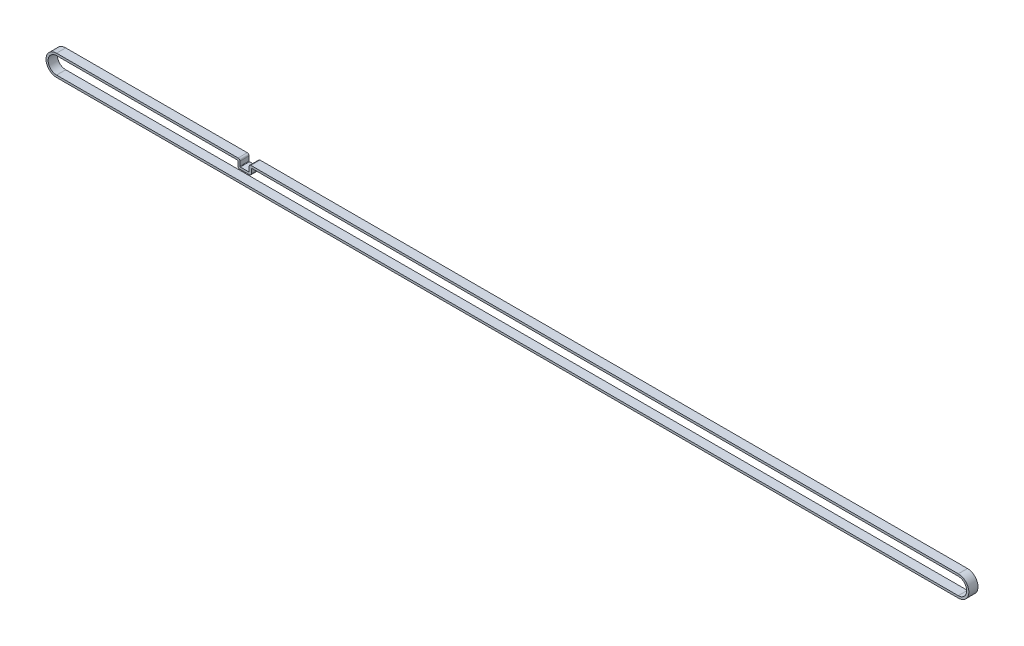
ISO-10303-21;
HEADER;
FILE_DESCRIPTION(('STEP AP214'),'2;1');
FILE_NAME('part.step','',(''),(''),'','','');
FILE_SCHEMA(('AUTOMOTIVE_DESIGN { 1 0 10303 214 1 1 1 1 }'));
ENDSEC;
DATA;
#1=APPLICATION_CONTEXT('core data for automotive mechanical design processes');
#2=APPLICATION_PROTOCOL_DEFINITION('international standard','automotive_design',2000,#1);
#3=PRODUCT_CONTEXT('',#1,'mechanical');
#4=PRODUCT('Part','Part','',(#3));
#5=PRODUCT_RELATED_PRODUCT_CATEGORY('part','',(#4));
#6=PRODUCT_DEFINITION_FORMATION('','',#4);
#7=PRODUCT_DEFINITION_CONTEXT('part definition',#1,'design');
#8=PRODUCT_DEFINITION('design','',#6,#7);
#9=PRODUCT_DEFINITION_SHAPE('','',#8);
#10=(LENGTH_UNIT() NAMED_UNIT(*) SI_UNIT(.MILLI.,.METRE.));
#11=(NAMED_UNIT(*) PLANE_ANGLE_UNIT() SI_UNIT($,.RADIAN.));
#12=(NAMED_UNIT(*) SI_UNIT($,.STERADIAN.) SOLID_ANGLE_UNIT());
#13=UNCERTAINTY_MEASURE_WITH_UNIT(LENGTH_MEASURE(1.E-05),#10,'distance_accuracy_value','');
#14=(GEOMETRIC_REPRESENTATION_CONTEXT(3) GLOBAL_UNCERTAINTY_ASSIGNED_CONTEXT((#13)) GLOBAL_UNIT_ASSIGNED_CONTEXT((#10,
#11,#12)) REPRESENTATION_CONTEXT('',''));
#15=CARTESIAN_POINT('',(0.,0.,0.));
#16=DIRECTION('',(0.,0.,1.));
#17=DIRECTION('',(1.,0.,0.));
#18=AXIS2_PLACEMENT_3D('',#15,#16,#17);
#19=CARTESIAN_POINT('',(0.,0.,6.));
#20=DIRECTION('',(0.,0.,1.));
#21=DIRECTION('',(1.,0.,0.));
#22=AXIS2_PLACEMENT_3D('',#19,#20,#21);
#23=PLANE('',#22);
#24=DIRECTION('',(-1.,0.,0.));
#25=VECTOR('',#24,1.);
#26=CARTESIAN_POINT('',(126.,6.9,6.));
#27=LINE('',#26,#25);
#28=CARTESIAN_POINT('',(590.,6.9,6.));
#29=VERTEX_POINT('',#28);
#30=CARTESIAN_POINT('',(127.2,6.9,6.));
#31=VERTEX_POINT('',#30);
#32=EDGE_CURVE('E271',#29,#31,#27,.T.);
#33=ORIENTED_EDGE('',*,*,#32,.T.);
#34=CARTESIAN_POINT('',(127.2,5.7,6.));
#35=DIRECTION('',(0.,0.,1.));
#36=DIRECTION('',(1.,0.,0.));
#37=AXIS2_PLACEMENT_3D('',#34,#35,#36);
#38=CIRCLE('',#37,1.2);
#39=CARTESIAN_POINT('',(126.,5.7,6.));
#40=VERTEX_POINT('',#39);
#41=EDGE_CURVE('E368',#31,#40,#38,.T.);
#42=ORIENTED_EDGE('',*,*,#41,.T.);
#43=DIRECTION('',(0.,-1.,0.));
#44=VECTOR('',#43,1.);
#45=CARTESIAN_POINT('',(126.,2.5,6.));
#46=LINE('',#45,#44);
#47=CARTESIAN_POINT('',(126.,2.8,6.));
#48=VERTEX_POINT('',#47);
#49=EDGE_CURVE('E274',#40,#48,#46,.T.);
#50=ORIENTED_EDGE('',*,*,#49,.T.);
#51=CARTESIAN_POINT('',(125.7,2.8,6.));
#52=DIRECTION('',(0.,0.,1.));
#53=DIRECTION('',(1.,0.,0.));
#54=AXIS2_PLACEMENT_3D('',#51,#52,#53);
#55=CIRCLE('',#54,0.3);
#56=CARTESIAN_POINT('',(125.7,2.5,6.));
#57=VERTEX_POINT('',#56);
#58=EDGE_CURVE('E346',#48,#57,#55,.F.);
#59=ORIENTED_EDGE('',*,*,#58,.T.);
#60=DIRECTION('',(-1.,0.,0.));
#61=VECTOR('',#60,1.);
#62=CARTESIAN_POINT('',(120.,2.5,6.));
#63=LINE('',#62,#61);
#64=CARTESIAN_POINT('',(120.3,2.5,6.));
#65=VERTEX_POINT('',#64);
#66=EDGE_CURVE('E276',#57,#65,#63,.T.);
#67=ORIENTED_EDGE('',*,*,#66,.T.);
#68=CARTESIAN_POINT('',(120.3,2.8,6.));
#69=DIRECTION('',(0.,0.,1.));
#70=DIRECTION('',(1.,0.,0.));
#71=AXIS2_PLACEMENT_3D('',#68,#69,#70);
#72=CIRCLE('',#71,0.3);
#73=CARTESIAN_POINT('',(120.,2.8,6.));
#74=VERTEX_POINT('',#73);
#75=EDGE_CURVE('E350',#65,#74,#72,.F.);
#76=ORIENTED_EDGE('',*,*,#75,.T.);
#77=DIRECTION('',(0.,1.,0.));
#78=VECTOR('',#77,1.);
#79=CARTESIAN_POINT('',(120.,6.9,6.));
#80=LINE('',#79,#78);
#81=CARTESIAN_POINT('',(120.,5.7,6.));
#82=VERTEX_POINT('',#81);
#83=EDGE_CURVE('E279',#74,#82,#80,.T.);
#84=ORIENTED_EDGE('',*,*,#83,.T.);
#85=CARTESIAN_POINT('',(118.8,5.7,6.));
#86=DIRECTION('',(0.,0.,1.));
#87=DIRECTION('',(1.,0.,0.));
#88=AXIS2_PLACEMENT_3D('',#85,#86,#87);
#89=CIRCLE('',#88,1.2);
#90=CARTESIAN_POINT('',(118.8,6.9,6.));
#91=VERTEX_POINT('',#90);
#92=EDGE_CURVE('E60',#82,#91,#89,.T.);
#93=ORIENTED_EDGE('',*,*,#92,.T.);
#94=DIRECTION('',(-1.,0.,0.));
#95=VECTOR('',#94,1.);
#96=CARTESIAN_POINT('',(0.,6.9,6.));
#97=LINE('',#96,#95);
#98=CARTESIAN_POINT('',(0.,6.9,6.));
#99=VERTEX_POINT('',#98);
#100=EDGE_CURVE('E281',#91,#99,#97,.T.);
#101=ORIENTED_EDGE('',*,*,#100,.T.);
#102=CARTESIAN_POINT('',(0.,0.,6.));
#103=DIRECTION('',(0.,0.,1.));
#104=DIRECTION('',(1.,0.,0.));
#105=AXIS2_PLACEMENT_3D('',#102,#103,#104);
#106=CIRCLE('',#105,6.9);
#107=CARTESIAN_POINT('',(0.,-6.9,6.));
#108=VERTEX_POINT('',#107);
#109=EDGE_CURVE('E263',#99,#108,#106,.T.);
#110=ORIENTED_EDGE('',*,*,#109,.T.);
#111=DIRECTION('',(1.,0.,0.));
#112=VECTOR('',#111,1.);
#113=CARTESIAN_POINT('',(0.,-6.9,6.));
#114=LINE('',#113,#112);
#115=CARTESIAN_POINT('',(590.,-6.9,6.));
#116=VERTEX_POINT('',#115);
#117=EDGE_CURVE('E266',#108,#116,#114,.T.);
#118=ORIENTED_EDGE('',*,*,#117,.T.);
#119=CARTESIAN_POINT('',(590.,0.,6.));
#120=DIRECTION('',(0.,0.,1.));
#121=DIRECTION('',(1.,0.,0.));
#122=AXIS2_PLACEMENT_3D('',#119,#120,#121);
#123=CIRCLE('',#122,6.9);
#124=EDGE_CURVE('E269',#116,#29,#123,.T.);
#125=ORIENTED_EDGE('',*,*,#124,.T.);
#126=EDGE_LOOP('',(#33,#42,#50,#59,#67,#76,#84,#93,#101,#110,#118,#125));
#127=FACE_BOUND('',#126,.T.);
#128=DIRECTION('',(0.,1.,0.));
#129=VECTOR('',#128,1.);
#130=CARTESIAN_POINT('',(118.6,5.5,6.));
#131=LINE('',#130,#129);
#132=CARTESIAN_POINT('',(118.6,2.3,6.));
#133=VERTEX_POINT('',#132);
#134=CARTESIAN_POINT('',(118.6,5.2,6.));
#135=VERTEX_POINT('',#134);
#136=EDGE_CURVE('E237',#133,#135,#131,.T.);
#137=ORIENTED_EDGE('',*,*,#136,.F.);
#138=CARTESIAN_POINT('',(119.8,2.3,6.));
#139=DIRECTION('',(0.,0.,1.));
#140=DIRECTION('',(1.,0.,0.));
#141=AXIS2_PLACEMENT_3D('',#138,#139,#140);
#142=CIRCLE('',#141,1.2);
#143=CARTESIAN_POINT('',(119.8,1.1,6.));
#144=VERTEX_POINT('',#143);
#145=EDGE_CURVE('E371',#133,#144,#142,.T.);
#146=ORIENTED_EDGE('',*,*,#145,.T.);
#147=DIRECTION('',(-1.,0.,0.));
#148=VECTOR('',#147,1.);
#149=CARTESIAN_POINT('',(118.6,1.1,6.));
#150=LINE('',#149,#148);
#151=CARTESIAN_POINT('',(126.2,1.1,6.));
#152=VERTEX_POINT('',#151);
#153=EDGE_CURVE('E234',#152,#144,#150,.T.);
#154=ORIENTED_EDGE('',*,*,#153,.F.);
#155=CARTESIAN_POINT('',(126.2,2.3,6.));
#156=DIRECTION('',(0.,0.,1.));
#157=DIRECTION('',(1.,0.,0.));
#158=AXIS2_PLACEMENT_3D('',#155,#156,#157);
#159=CIRCLE('',#158,1.2);
#160=CARTESIAN_POINT('',(127.4,2.3,6.));
#161=VERTEX_POINT('',#160);
#162=EDGE_CURVE('E52',#152,#161,#159,.T.);
#163=ORIENTED_EDGE('',*,*,#162,.T.);
#164=DIRECTION('',(0.,-1.,0.));
#165=VECTOR('',#164,1.);
#166=CARTESIAN_POINT('',(127.4,1.1,6.));
#167=LINE('',#166,#165);
#168=CARTESIAN_POINT('',(127.4,5.2,6.));
#169=VERTEX_POINT('',#168);
#170=EDGE_CURVE('E232',#169,#161,#167,.T.);
#171=ORIENTED_EDGE('',*,*,#170,.F.);
#172=CARTESIAN_POINT('',(127.7,5.2,6.));
#173=DIRECTION('',(0.,0.,1.));
#174=DIRECTION('',(1.,0.,0.));
#175=AXIS2_PLACEMENT_3D('',#172,#173,#174);
#176=CIRCLE('',#175,0.3);
#177=CARTESIAN_POINT('',(127.7,5.5,6.));
#178=VERTEX_POINT('',#177);
#179=EDGE_CURVE('E336',#169,#178,#176,.F.);
#180=ORIENTED_EDGE('',*,*,#179,.T.);
#181=DIRECTION('',(-1.,0.,0.));
#182=VECTOR('',#181,1.);
#183=CARTESIAN_POINT('',(127.4,5.5,6.));
#184=LINE('',#183,#182);
#185=CARTESIAN_POINT('',(590.,5.5,6.));
#186=VERTEX_POINT('',#185);
#187=EDGE_CURVE('E227',#186,#178,#184,.T.);
#188=ORIENTED_EDGE('',*,*,#187,.F.);
#189=CARTESIAN_POINT('',(590.,0.,6.));
#190=DIRECTION('',(0.,0.,1.));
#191=DIRECTION('',(1.,0.,0.));
#192=AXIS2_PLACEMENT_3D('',#189,#190,#191);
#193=CIRCLE('',#192,5.5);
#194=CARTESIAN_POINT('',(590.,-5.5,6.));
#195=VERTEX_POINT('',#194);
#196=EDGE_CURVE('E225',#195,#186,#193,.T.);
#197=ORIENTED_EDGE('',*,*,#196,.F.);
#198=DIRECTION('',(1.,0.,0.));
#199=VECTOR('',#198,1.);
#200=CARTESIAN_POINT('',(0.,-5.5,6.));
#201=LINE('',#200,#199);
#202=CARTESIAN_POINT('',(0.,-5.5,6.));
#203=VERTEX_POINT('',#202);
#204=EDGE_CURVE('E211',#203,#195,#201,.T.);
#205=ORIENTED_EDGE('',*,*,#204,.F.);
#206=CARTESIAN_POINT('',(0.,0.,6.));
#207=DIRECTION('',(0.,0.,1.));
#208=DIRECTION('',(1.,0.,0.));
#209=AXIS2_PLACEMENT_3D('',#206,#207,#208);
#210=CIRCLE('',#209,5.5);
#211=CARTESIAN_POINT('',(0.,5.5,6.));
#212=VERTEX_POINT('',#211);
#213=EDGE_CURVE('E201',#212,#203,#210,.T.);
#214=ORIENTED_EDGE('',*,*,#213,.F.);
#215=DIRECTION('',(-1.,0.,0.));
#216=VECTOR('',#215,1.);
#217=CARTESIAN_POINT('',(0.,5.5,6.));
#218=LINE('',#217,#216);
#219=CARTESIAN_POINT('',(118.3,5.5,6.));
#220=VERTEX_POINT('',#219);
#221=EDGE_CURVE('E239',#220,#212,#218,.T.);
#222=ORIENTED_EDGE('',*,*,#221,.F.);
#223=CARTESIAN_POINT('',(118.3,5.2,6.));
#224=DIRECTION('',(0.,0.,1.));
#225=DIRECTION('',(1.,0.,0.));
#226=AXIS2_PLACEMENT_3D('',#223,#224,#225);
#227=CIRCLE('',#226,0.3);
#228=EDGE_CURVE('E340',#220,#135,#227,.F.);
#229=ORIENTED_EDGE('',*,*,#228,.T.);
#230=EDGE_LOOP('',(#137,#146,#154,#163,#171,#180,#188,#197,#205,#214,#222,#229));
#231=FACE_BOUND('',#230,.T.);
#232=ADVANCED_FACE('F37',(#127,#231),#23,.T.);
#233=CARTESIAN_POINT('',(0.,0.,0.));
#234=DIRECTION('',(0.,0.,1.));
#235=DIRECTION('',(1.,0.,0.));
#236=AXIS2_PLACEMENT_3D('',#233,#234,#235);
#237=PLANE('',#236);
#238=DIRECTION('',(0.,-1.,0.));
#239=VECTOR('',#238,1.);
#240=CARTESIAN_POINT('',(126.,2.5,0.));
#241=LINE('',#240,#239);
#242=CARTESIAN_POINT('',(126.,5.7,0.));
#243=VERTEX_POINT('',#242);
#244=CARTESIAN_POINT('',(126.,2.8,0.));
#245=VERTEX_POINT('',#244);
#246=EDGE_CURVE('E293',#243,#245,#241,.T.);
#247=ORIENTED_EDGE('',*,*,#246,.F.);
#248=CARTESIAN_POINT('',(127.2,5.7,0.));
#249=DIRECTION('',(0.,0.,1.));
#250=DIRECTION('',(1.,0.,0.));
#251=AXIS2_PLACEMENT_3D('',#248,#249,#250);
#252=CIRCLE('',#251,1.2);
#253=CARTESIAN_POINT('',(127.2,6.9,0.));
#254=VERTEX_POINT('',#253);
#255=EDGE_CURVE('E359',#243,#254,#252,.F.);
#256=ORIENTED_EDGE('',*,*,#255,.T.);
#257=DIRECTION('',(-1.,0.,0.));
#258=VECTOR('',#257,1.);
#259=CARTESIAN_POINT('',(126.,6.9,0.));
#260=LINE('',#259,#258);
#261=CARTESIAN_POINT('',(590.,6.9,0.));
#262=VERTEX_POINT('',#261);
#263=EDGE_CURVE('E290',#262,#254,#260,.T.);
#264=ORIENTED_EDGE('',*,*,#263,.F.);
#265=CARTESIAN_POINT('',(590.,0.,0.));
#266=DIRECTION('',(0.,0.,1.));
#267=DIRECTION('',(1.,0.,0.));
#268=AXIS2_PLACEMENT_3D('',#265,#266,#267);
#269=CIRCLE('',#268,6.9);
#270=CARTESIAN_POINT('',(590.,-6.9,0.));
#271=VERTEX_POINT('',#270);
#272=EDGE_CURVE('E288',#271,#262,#269,.T.);
#273=ORIENTED_EDGE('',*,*,#272,.F.);
#274=DIRECTION('',(1.,0.,0.));
#275=VECTOR('',#274,1.);
#276=CARTESIAN_POINT('',(0.,-6.9,0.));
#277=LINE('',#276,#275);
#278=CARTESIAN_POINT('',(0.,-6.9,0.));
#279=VERTEX_POINT('',#278);
#280=EDGE_CURVE('E286',#279,#271,#277,.T.);
#281=ORIENTED_EDGE('',*,*,#280,.F.);
#282=CARTESIAN_POINT('',(0.,0.,0.));
#283=DIRECTION('',(0.,0.,1.));
#284=DIRECTION('',(1.,0.,0.));
#285=AXIS2_PLACEMENT_3D('',#282,#283,#284);
#286=CIRCLE('',#285,6.9);
#287=CARTESIAN_POINT('',(0.,6.9,0.));
#288=VERTEX_POINT('',#287);
#289=EDGE_CURVE('E219',#288,#279,#286,.T.);
#290=ORIENTED_EDGE('',*,*,#289,.F.);
#291=DIRECTION('',(-1.,0.,0.));
#292=VECTOR('',#291,1.);
#293=CARTESIAN_POINT('',(0.,6.9,0.));
#294=LINE('',#293,#292);
#295=CARTESIAN_POINT('',(118.8,6.9,0.));
#296=VERTEX_POINT('',#295);
#297=EDGE_CURVE('E267',#296,#288,#294,.T.);
#298=ORIENTED_EDGE('',*,*,#297,.F.);
#299=CARTESIAN_POINT('',(118.8,5.7,0.));
#300=DIRECTION('',(0.,0.,1.));
#301=DIRECTION('',(1.,0.,0.));
#302=AXIS2_PLACEMENT_3D('',#299,#300,#301);
#303=CIRCLE('',#302,1.2);
#304=CARTESIAN_POINT('',(120.,5.7,0.));
#305=VERTEX_POINT('',#304);
#306=EDGE_CURVE('E357',#296,#305,#303,.F.);
#307=ORIENTED_EDGE('',*,*,#306,.T.);
#308=DIRECTION('',(0.,1.,0.));
#309=VECTOR('',#308,1.);
#310=CARTESIAN_POINT('',(120.,6.9,0.));
#311=LINE('',#310,#309);
#312=CARTESIAN_POINT('',(120.,2.8,0.));
#313=VERTEX_POINT('',#312);
#314=EDGE_CURVE('E298',#313,#305,#311,.T.);
#315=ORIENTED_EDGE('',*,*,#314,.F.);
#316=CARTESIAN_POINT('',(120.3,2.8,0.));
#317=DIRECTION('',(0.,0.,1.));
#318=DIRECTION('',(1.,0.,0.));
#319=AXIS2_PLACEMENT_3D('',#316,#317,#318);
#320=CIRCLE('',#319,0.3);
#321=CARTESIAN_POINT('',(120.3,2.5,0.));
#322=VERTEX_POINT('',#321);
#323=EDGE_CURVE('E348',#313,#322,#320,.T.);
#324=ORIENTED_EDGE('',*,*,#323,.T.);
#325=DIRECTION('',(-1.,0.,0.));
#326=VECTOR('',#325,1.);
#327=CARTESIAN_POINT('',(120.,2.5,0.));
#328=LINE('',#327,#326);
#329=CARTESIAN_POINT('',(125.7,2.5,0.));
#330=VERTEX_POINT('',#329);
#331=EDGE_CURVE('E295',#330,#322,#328,.T.);
#332=ORIENTED_EDGE('',*,*,#331,.F.);
#333=CARTESIAN_POINT('',(125.7,2.8,0.));
#334=DIRECTION('',(0.,0.,1.));
#335=DIRECTION('',(1.,0.,0.));
#336=AXIS2_PLACEMENT_3D('',#333,#334,#335);
#337=CIRCLE('',#336,0.3);
#338=EDGE_CURVE('E343',#330,#245,#337,.T.);
#339=ORIENTED_EDGE('',*,*,#338,.T.);
#340=EDGE_LOOP('',(#247,#256,#264,#273,#281,#290,#298,#307,#315,#324,#332,#339));
#341=FACE_BOUND('',#340,.T.);
#342=DIRECTION('',(-1.,0.,0.));
#343=VECTOR('',#342,1.);
#344=CARTESIAN_POINT('',(118.6,1.1,0.));
#345=LINE('',#344,#343);
#346=CARTESIAN_POINT('',(126.2,1.1,0.));
#347=VERTEX_POINT('',#346);
#348=CARTESIAN_POINT('',(119.8,1.1,0.));
#349=VERTEX_POINT('',#348);
#350=EDGE_CURVE('E253',#347,#349,#345,.T.);
#351=ORIENTED_EDGE('',*,*,#350,.T.);
#352=CARTESIAN_POINT('',(119.8,2.3,0.));
#353=DIRECTION('',(0.,0.,1.));
#354=DIRECTION('',(1.,0.,0.));
#355=AXIS2_PLACEMENT_3D('',#352,#353,#354);
#356=CIRCLE('',#355,1.2);
#357=CARTESIAN_POINT('',(118.6,2.3,0.));
#358=VERTEX_POINT('',#357);
#359=EDGE_CURVE('E363',#349,#358,#356,.F.);
#360=ORIENTED_EDGE('',*,*,#359,.T.);
#361=DIRECTION('',(0.,1.,0.));
#362=VECTOR('',#361,1.);
#363=CARTESIAN_POINT('',(118.6,5.5,0.));
#364=LINE('',#363,#362);
#365=CARTESIAN_POINT('',(118.6,5.2,0.));
#366=VERTEX_POINT('',#365);
#367=EDGE_CURVE('E256',#358,#366,#364,.T.);
#368=ORIENTED_EDGE('',*,*,#367,.T.);
#369=CARTESIAN_POINT('',(118.3,5.2,0.));
#370=DIRECTION('',(0.,0.,1.));
#371=DIRECTION('',(1.,0.,0.));
#372=AXIS2_PLACEMENT_3D('',#369,#370,#371);
#373=CIRCLE('',#372,0.3);
#374=CARTESIAN_POINT('',(118.3,5.5,0.));
#375=VERTEX_POINT('',#374);
#376=EDGE_CURVE('E338',#366,#375,#373,.T.);
#377=ORIENTED_EDGE('',*,*,#376,.T.);
#378=DIRECTION('',(-1.,0.,0.));
#379=VECTOR('',#378,1.);
#380=CARTESIAN_POINT('',(0.,5.5,0.));
#381=LINE('',#380,#379);
#382=CARTESIAN_POINT('',(0.,5.5,0.));
#383=VERTEX_POINT('',#382);
#384=EDGE_CURVE('E212',#375,#383,#381,.T.);
#385=ORIENTED_EDGE('',*,*,#384,.T.);
#386=CARTESIAN_POINT('',(0.,0.,0.));
#387=DIRECTION('',(0.,0.,1.));
#388=DIRECTION('',(1.,0.,0.));
#389=AXIS2_PLACEMENT_3D('',#386,#387,#388);
#390=CIRCLE('',#389,5.5);
#391=CARTESIAN_POINT('',(0.,-5.5,0.));
#392=VERTEX_POINT('',#391);
#393=EDGE_CURVE('E241',#383,#392,#390,.T.);
#394=ORIENTED_EDGE('',*,*,#393,.T.);
#395=DIRECTION('',(1.,0.,0.));
#396=VECTOR('',#395,1.);
#397=CARTESIAN_POINT('',(0.,-5.5,0.));
#398=LINE('',#397,#396);
#399=CARTESIAN_POINT('',(590.,-5.5,0.));
#400=VERTEX_POINT('',#399);
#401=EDGE_CURVE('E218',#392,#400,#398,.T.);
#402=ORIENTED_EDGE('',*,*,#401,.T.);
#403=CARTESIAN_POINT('',(590.,0.,0.));
#404=DIRECTION('',(0.,0.,1.));
#405=DIRECTION('',(1.,0.,0.));
#406=AXIS2_PLACEMENT_3D('',#403,#404,#405);
#407=CIRCLE('',#406,5.5);
#408=CARTESIAN_POINT('',(590.,5.5,0.));
#409=VERTEX_POINT('',#408);
#410=EDGE_CURVE('E244',#400,#409,#407,.T.);
#411=ORIENTED_EDGE('',*,*,#410,.T.);
#412=DIRECTION('',(-1.,0.,0.));
#413=VECTOR('',#412,1.);
#414=CARTESIAN_POINT('',(127.4,5.5,0.));
#415=LINE('',#414,#413);
#416=CARTESIAN_POINT('',(127.7,5.5,0.));
#417=VERTEX_POINT('',#416);
#418=EDGE_CURVE('E247',#409,#417,#415,.T.);
#419=ORIENTED_EDGE('',*,*,#418,.T.);
#420=CARTESIAN_POINT('',(127.7,5.2,0.));
#421=DIRECTION('',(0.,0.,1.));
#422=DIRECTION('',(1.,0.,0.));
#423=AXIS2_PLACEMENT_3D('',#420,#421,#422);
#424=CIRCLE('',#423,0.3);
#425=CARTESIAN_POINT('',(127.4,5.2,0.));
#426=VERTEX_POINT('',#425);
#427=EDGE_CURVE('E334',#417,#426,#424,.T.);
#428=ORIENTED_EDGE('',*,*,#427,.T.);
#429=DIRECTION('',(0.,-1.,0.));
#430=VECTOR('',#429,1.);
#431=CARTESIAN_POINT('',(127.4,1.1,0.));
#432=LINE('',#431,#430);
#433=CARTESIAN_POINT('',(127.4,2.3,0.));
#434=VERTEX_POINT('',#433);
#435=EDGE_CURVE('E250',#426,#434,#432,.T.);
#436=ORIENTED_EDGE('',*,*,#435,.T.);
#437=CARTESIAN_POINT('',(126.2,2.3,0.));
#438=DIRECTION('',(0.,0.,1.));
#439=DIRECTION('',(1.,0.,0.));
#440=AXIS2_PLACEMENT_3D('',#437,#438,#439);
#441=CIRCLE('',#440,1.2);
#442=EDGE_CURVE('E361',#434,#347,#441,.F.);
#443=ORIENTED_EDGE('',*,*,#442,.T.);
#444=EDGE_LOOP('',(#351,#360,#368,#377,#385,#394,#402,#411,#419,#428,#436,#443));
#445=FACE_BOUND('',#444,.T.);
#446=ADVANCED_FACE('F390',(#341,#445),#237,.F.);
#447=CARTESIAN_POINT('',(0.,0.,6.));
#448=DIRECTION('',(0.,0.,-1.));
#449=DIRECTION('',(-1.,0.,0.));
#450=AXIS2_PLACEMENT_3D('',#447,#448,#449);
#451=CYLINDRICAL_SURFACE('',#450,6.9);
#452=ORIENTED_EDGE('',*,*,#289,.T.);
#453=DIRECTION('',(0.,0.,-1.));
#454=VECTOR('',#453,1.);
#455=CARTESIAN_POINT('',(0.,-6.9,6.));
#456=LINE('',#455,#454);
#457=EDGE_CURVE('E310',#108,#279,#456,.T.);
#458=ORIENTED_EDGE('',*,*,#457,.F.);
#459=ORIENTED_EDGE('',*,*,#109,.F.);
#460=DIRECTION('',(0.,0.,-1.));
#461=VECTOR('',#460,1.);
#462=CARTESIAN_POINT('',(0.,6.9,6.));
#463=LINE('',#462,#461);
#464=EDGE_CURVE('E283',#99,#288,#463,.T.);
#465=ORIENTED_EDGE('',*,*,#464,.T.);
#466=EDGE_LOOP('',(#452,#458,#459,#465));
#467=FACE_BOUND('',#466,.T.);
#468=ADVANCED_FACE('F396',(#467),#451,.T.);
#469=CARTESIAN_POINT('',(0.,-6.9,6.));
#470=DIRECTION('',(0.,1.,0.));
#471=DIRECTION('',(0.,0.,1.));
#472=AXIS2_PLACEMENT_3D('',#469,#470,#471);
#473=PLANE('',#472);
#474=ORIENTED_EDGE('',*,*,#280,.T.);
#475=DIRECTION('',(0.,0.,-1.));
#476=VECTOR('',#475,1.);
#477=CARTESIAN_POINT('',(590.,-6.9,6.));
#478=LINE('',#477,#476);
#479=EDGE_CURVE('E307',#116,#271,#478,.T.);
#480=ORIENTED_EDGE('',*,*,#479,.F.);
#481=ORIENTED_EDGE('',*,*,#117,.F.);
#482=ORIENTED_EDGE('',*,*,#457,.T.);
#483=EDGE_LOOP('',(#474,#480,#481,#482));
#484=FACE_BOUND('',#483,.T.);
#485=ADVANCED_FACE('F402',(#484),#473,.F.);
#486=CARTESIAN_POINT('',(590.,0.,6.));
#487=DIRECTION('',(0.,0.,-1.));
#488=DIRECTION('',(-1.,0.,0.));
#489=AXIS2_PLACEMENT_3D('',#486,#487,#488);
#490=CYLINDRICAL_SURFACE('',#489,6.9);
#491=ORIENTED_EDGE('',*,*,#272,.T.);
#492=DIRECTION('',(0.,0.,-1.));
#493=VECTOR('',#492,1.);
#494=CARTESIAN_POINT('',(590.,6.9,6.));
#495=LINE('',#494,#493);
#496=EDGE_CURVE('E304',#29,#262,#495,.T.);
#497=ORIENTED_EDGE('',*,*,#496,.F.);
#498=ORIENTED_EDGE('',*,*,#124,.F.);
#499=ORIENTED_EDGE('',*,*,#479,.T.);
#500=EDGE_LOOP('',(#491,#497,#498,#499));
#501=FACE_BOUND('',#500,.T.);
#502=ADVANCED_FACE('F404',(#501),#490,.T.);
#503=CARTESIAN_POINT('',(126.,6.9,6.));
#504=DIRECTION('',(0.,-1.,0.));
#505=DIRECTION('',(0.,0.,-1.));
#506=AXIS2_PLACEMENT_3D('',#503,#504,#505);
#507=PLANE('',#506);
#508=ORIENTED_EDGE('',*,*,#263,.T.);
#509=DIRECTION('',(0.,0.,-1.));
#510=VECTOR('',#509,1.);
#511=CARTESIAN_POINT('',(127.2,6.9,6.));
#512=LINE('',#511,#510);
#513=EDGE_CURVE('E379',#254,#31,#512,.F.);
#514=ORIENTED_EDGE('',*,*,#513,.T.);
#515=ORIENTED_EDGE('',*,*,#32,.F.);
#516=ORIENTED_EDGE('',*,*,#496,.T.);
#517=EDGE_LOOP('',(#508,#514,#515,#516));
#518=FACE_BOUND('',#517,.T.);
#519=ADVANCED_FACE('F408',(#518),#507,.F.);
#520=CARTESIAN_POINT('',(126.,2.5,6.));
#521=DIRECTION('',(1.,0.,0.));
#522=DIRECTION('',(0.,0.,-1.));
#523=AXIS2_PLACEMENT_3D('',#520,#521,#522);
#524=PLANE('',#523);
#525=ORIENTED_EDGE('',*,*,#49,.F.);
#526=DIRECTION('',(0.,0.,-1.));
#527=VECTOR('',#526,1.);
#528=CARTESIAN_POINT('',(126.,5.7,6.));
#529=LINE('',#528,#527);
#530=EDGE_CURVE('E376',#40,#243,#529,.T.);
#531=ORIENTED_EDGE('',*,*,#530,.T.);
#532=ORIENTED_EDGE('',*,*,#246,.T.);
#533=DIRECTION('',(0.,0.,-1.));
#534=VECTOR('',#533,1.);
#535=CARTESIAN_POINT('',(126.,2.8,6.));
#536=LINE('',#535,#534);
#537=EDGE_CURVE('E328',#245,#48,#536,.F.);
#538=ORIENTED_EDGE('',*,*,#537,.T.);
#539=EDGE_LOOP('',(#525,#531,#532,#538));
#540=FACE_BOUND('',#539,.T.);
#541=ADVANCED_FACE('F416',(#540),#524,.F.);
#542=CARTESIAN_POINT('',(120.,2.5,6.));
#543=DIRECTION('',(0.,-1.,0.));
#544=DIRECTION('',(1.,0.,0.));
#545=AXIS2_PLACEMENT_3D('',#542,#543,#544);
#546=PLANE('',#545);
#547=ORIENTED_EDGE('',*,*,#66,.F.);
#548=DIRECTION('',(0.,0.,-1.));
#549=VECTOR('',#548,1.);
#550=CARTESIAN_POINT('',(125.7,2.5,0.));
#551=LINE('',#550,#549);
#552=EDGE_CURVE('E325',#57,#330,#551,.T.);
#553=ORIENTED_EDGE('',*,*,#552,.T.);
#554=ORIENTED_EDGE('',*,*,#331,.T.);
#555=DIRECTION('',(0.,0.,-1.));
#556=VECTOR('',#555,1.);
#557=CARTESIAN_POINT('',(120.3,2.5,6.));
#558=LINE('',#557,#556);
#559=EDGE_CURVE('E323',#322,#65,#558,.F.);
#560=ORIENTED_EDGE('',*,*,#559,.T.);
#561=EDGE_LOOP('',(#547,#553,#554,#560));
#562=FACE_BOUND('',#561,.T.);
#563=ADVANCED_FACE('F426',(#562),#546,.F.);
#564=CARTESIAN_POINT('',(120.,6.9,6.));
#565=DIRECTION('',(-1.,0.,0.));
#566=DIRECTION('',(0.,0.,1.));
#567=AXIS2_PLACEMENT_3D('',#564,#565,#566);
#568=PLANE('',#567);
#569=ORIENTED_EDGE('',*,*,#314,.T.);
#570=DIRECTION('',(0.,0.,-1.));
#571=VECTOR('',#570,1.);
#572=CARTESIAN_POINT('',(120.,5.7,6.));
#573=LINE('',#572,#571);
#574=EDGE_CURVE('E11',#305,#82,#573,.F.);
#575=ORIENTED_EDGE('',*,*,#574,.T.);
#576=ORIENTED_EDGE('',*,*,#83,.F.);
#577=DIRECTION('',(0.,0.,-1.));
#578=VECTOR('',#577,1.);
#579=CARTESIAN_POINT('',(120.,2.8,0.));
#580=LINE('',#579,#578);
#581=EDGE_CURVE('E331',#74,#313,#580,.T.);
#582=ORIENTED_EDGE('',*,*,#581,.T.);
#583=EDGE_LOOP('',(#569,#575,#576,#582));
#584=FACE_BOUND('',#583,.T.);
#585=ADVANCED_FACE('F433',(#584),#568,.F.);
#586=CARTESIAN_POINT('',(0.,6.9,6.));
#587=DIRECTION('',(0.,-1.,0.));
#588=DIRECTION('',(0.,0.,-1.));
#589=AXIS2_PLACEMENT_3D('',#586,#587,#588);
#590=PLANE('',#589);
#591=ORIENTED_EDGE('',*,*,#100,.F.);
#592=DIRECTION('',(0.,0.,-1.));
#593=VECTOR('',#592,1.);
#594=CARTESIAN_POINT('',(118.8,6.9,6.));
#595=LINE('',#594,#593);
#596=EDGE_CURVE('E45',#91,#296,#595,.T.);
#597=ORIENTED_EDGE('',*,*,#596,.T.);
#598=ORIENTED_EDGE('',*,*,#297,.T.);
#599=ORIENTED_EDGE('',*,*,#464,.F.);
#600=EDGE_LOOP('',(#591,#597,#598,#599));
#601=FACE_BOUND('',#600,.T.);
#602=ADVANCED_FACE('F384',(#601),#590,.F.);
#603=CARTESIAN_POINT('',(0.,0.,6.));
#604=DIRECTION('',(0.,0.,-1.));
#605=DIRECTION('',(-1.,0.,0.));
#606=AXIS2_PLACEMENT_3D('',#603,#604,#605);
#607=CYLINDRICAL_SURFACE('',#606,5.5);
#608=ORIENTED_EDGE('',*,*,#393,.F.);
#609=DIRECTION('',(0.,0.,-1.));
#610=VECTOR('',#609,1.);
#611=CARTESIAN_POINT('',(0.,5.5,6.));
#612=LINE('',#611,#610);
#613=EDGE_CURVE('E208',#212,#383,#612,.T.);
#614=ORIENTED_EDGE('',*,*,#613,.F.);
#615=ORIENTED_EDGE('',*,*,#213,.T.);
#616=DIRECTION('',(0.,0.,-1.));
#617=VECTOR('',#616,1.);
#618=CARTESIAN_POINT('',(0.,-5.5,6.));
#619=LINE('',#618,#617);
#620=EDGE_CURVE('E205',#203,#392,#619,.T.);
#621=ORIENTED_EDGE('',*,*,#620,.T.);
#622=EDGE_LOOP('',(#608,#614,#615,#621));
#623=FACE_BOUND('',#622,.T.);
#624=ADVANCED_FACE('F204',(#623),#607,.F.);
#625=CARTESIAN_POINT('',(0.,-5.5,6.));
#626=DIRECTION('',(0.,1.,0.));
#627=DIRECTION('',(0.,0.,1.));
#628=AXIS2_PLACEMENT_3D('',#625,#626,#627);
#629=PLANE('',#628);
#630=ORIENTED_EDGE('',*,*,#401,.F.);
#631=ORIENTED_EDGE('',*,*,#620,.F.);
#632=ORIENTED_EDGE('',*,*,#204,.T.);
#633=DIRECTION('',(0.,0.,-1.));
#634=VECTOR('',#633,1.);
#635=CARTESIAN_POINT('',(590.,-5.5,6.));
#636=LINE('',#635,#634);
#637=EDGE_CURVE('E220',#195,#400,#636,.T.);
#638=ORIENTED_EDGE('',*,*,#637,.T.);
#639=EDGE_LOOP('',(#630,#631,#632,#638));
#640=FACE_BOUND('',#639,.T.);
#641=ADVANCED_FACE('F215',(#640),#629,.T.);
#642=CARTESIAN_POINT('',(590.,0.,6.));
#643=DIRECTION('',(0.,0.,-1.));
#644=DIRECTION('',(-1.,0.,0.));
#645=AXIS2_PLACEMENT_3D('',#642,#643,#644);
#646=CYLINDRICAL_SURFACE('',#645,5.5);
#647=ORIENTED_EDGE('',*,*,#410,.F.);
#648=ORIENTED_EDGE('',*,*,#637,.F.);
#649=ORIENTED_EDGE('',*,*,#196,.T.);
#650=DIRECTION('',(0.,0.,-1.));
#651=VECTOR('',#650,1.);
#652=CARTESIAN_POINT('',(590.,5.5,6.));
#653=LINE('',#652,#651);
#654=EDGE_CURVE('E260',#186,#409,#653,.T.);
#655=ORIENTED_EDGE('',*,*,#654,.T.);
#656=EDGE_LOOP('',(#647,#648,#649,#655));
#657=FACE_BOUND('',#656,.T.);
#658=ADVANCED_FACE('F501',(#657),#646,.F.);
#659=CARTESIAN_POINT('',(127.4,5.5,6.));
#660=DIRECTION('',(0.,-1.,0.));
#661=DIRECTION('',(0.,0.,-1.));
#662=AXIS2_PLACEMENT_3D('',#659,#660,#661);
#663=PLANE('',#662);
#664=ORIENTED_EDGE('',*,*,#187,.T.);
#665=DIRECTION('',(0.,0.,-1.));
#666=VECTOR('',#665,1.);
#667=CARTESIAN_POINT('',(127.7,5.5,0.));
#668=LINE('',#667,#666);
#669=EDGE_CURVE('E313',#178,#417,#668,.T.);
#670=ORIENTED_EDGE('',*,*,#669,.T.);
#671=ORIENTED_EDGE('',*,*,#418,.F.);
#672=ORIENTED_EDGE('',*,*,#654,.F.);
#673=EDGE_LOOP('',(#664,#670,#671,#672));
#674=FACE_BOUND('',#673,.T.);
#675=ADVANCED_FACE('F497',(#674),#663,.T.);
#676=CARTESIAN_POINT('',(127.4,1.1,6.));
#677=DIRECTION('',(1.,0.,0.));
#678=DIRECTION('',(0.,0.,-1.));
#679=AXIS2_PLACEMENT_3D('',#676,#677,#678);
#680=PLANE('',#679);
#681=ORIENTED_EDGE('',*,*,#170,.T.);
#682=DIRECTION('',(0.,0.,-1.));
#683=VECTOR('',#682,1.);
#684=CARTESIAN_POINT('',(127.4,2.3,6.));
#685=LINE('',#684,#683);
#686=EDGE_CURVE('E373',#161,#434,#685,.T.);
#687=ORIENTED_EDGE('',*,*,#686,.T.);
#688=ORIENTED_EDGE('',*,*,#435,.F.);
#689=DIRECTION('',(0.,0.,-1.));
#690=VECTOR('',#689,1.);
#691=CARTESIAN_POINT('',(127.4,5.2,6.));
#692=LINE('',#691,#690);
#693=EDGE_CURVE('E316',#426,#169,#692,.F.);
#694=ORIENTED_EDGE('',*,*,#693,.T.);
#695=EDGE_LOOP('',(#681,#687,#688,#694));
#696=FACE_BOUND('',#695,.T.);
#697=ADVANCED_FACE('F490',(#696),#680,.T.);
#698=CARTESIAN_POINT('',(118.6,1.1,6.));
#699=DIRECTION('',(0.,-1.,0.));
#700=DIRECTION('',(0.,0.,-1.));
#701=AXIS2_PLACEMENT_3D('',#698,#699,#700);
#702=PLANE('',#701);
#703=ORIENTED_EDGE('',*,*,#153,.T.);
#704=DIRECTION('',(0.,0.,-1.));
#705=VECTOR('',#704,1.);
#706=CARTESIAN_POINT('',(119.8,1.1,6.));
#707=LINE('',#706,#705);
#708=EDGE_CURVE('E354',#144,#349,#707,.T.);
#709=ORIENTED_EDGE('',*,*,#708,.T.);
#710=ORIENTED_EDGE('',*,*,#350,.F.);
#711=DIRECTION('',(0.,0.,-1.));
#712=VECTOR('',#711,1.);
#713=CARTESIAN_POINT('',(126.2,1.1,6.));
#714=LINE('',#713,#712);
#715=EDGE_CURVE('E352',#347,#152,#714,.F.);
#716=ORIENTED_EDGE('',*,*,#715,.T.);
#717=EDGE_LOOP('',(#703,#709,#710,#716));
#718=FACE_BOUND('',#717,.T.);
#719=ADVANCED_FACE('F515',(#718),#702,.T.);
#720=CARTESIAN_POINT('',(118.6,5.5,6.));
#721=DIRECTION('',(-1.,0.,0.));
#722=DIRECTION('',(0.,0.,1.));
#723=AXIS2_PLACEMENT_3D('',#720,#721,#722);
#724=PLANE('',#723);
#725=ORIENTED_EDGE('',*,*,#367,.F.);
#726=DIRECTION('',(0.,0.,-1.));
#727=VECTOR('',#726,1.);
#728=CARTESIAN_POINT('',(118.6,2.3,6.));
#729=LINE('',#728,#727);
#730=EDGE_CURVE('E365',#358,#133,#729,.F.);
#731=ORIENTED_EDGE('',*,*,#730,.T.);
#732=ORIENTED_EDGE('',*,*,#136,.T.);
#733=DIRECTION('',(0.,0.,-1.));
#734=VECTOR('',#733,1.);
#735=CARTESIAN_POINT('',(118.6,5.2,0.));
#736=LINE('',#735,#734);
#737=EDGE_CURVE('E318',#135,#366,#736,.T.);
#738=ORIENTED_EDGE('',*,*,#737,.T.);
#739=EDGE_LOOP('',(#725,#731,#732,#738));
#740=FACE_BOUND('',#739,.T.);
#741=ADVANCED_FACE('F510',(#740),#724,.T.);
#742=CARTESIAN_POINT('',(0.,5.5,6.));
#743=DIRECTION('',(0.,-1.,0.));
#744=DIRECTION('',(0.,0.,-1.));
#745=AXIS2_PLACEMENT_3D('',#742,#743,#744);
#746=PLANE('',#745);
#747=ORIENTED_EDGE('',*,*,#384,.F.);
#748=DIRECTION('',(0.,0.,-1.));
#749=VECTOR('',#748,1.);
#750=CARTESIAN_POINT('',(118.3,5.5,6.));
#751=LINE('',#750,#749);
#752=EDGE_CURVE('E321',#375,#220,#751,.F.);
#753=ORIENTED_EDGE('',*,*,#752,.T.);
#754=ORIENTED_EDGE('',*,*,#221,.T.);
#755=ORIENTED_EDGE('',*,*,#613,.T.);
#756=EDGE_LOOP('',(#747,#753,#754,#755));
#757=FACE_BOUND('',#756,.T.);
#758=ADVANCED_FACE('F469',(#757),#746,.T.);
#759=CARTESIAN_POINT('',(127.7,5.2,6.));
#760=DIRECTION('',(0.,0.,1.));
#761=DIRECTION('',(1.,0.,0.));
#762=AXIS2_PLACEMENT_3D('',#759,#760,#761);
#763=CYLINDRICAL_SURFACE('',#762,0.3);
#764=ORIENTED_EDGE('',*,*,#179,.F.);
#765=ORIENTED_EDGE('',*,*,#693,.F.);
#766=ORIENTED_EDGE('',*,*,#427,.F.);
#767=ORIENTED_EDGE('',*,*,#669,.F.);
#768=EDGE_LOOP('',(#764,#765,#766,#767));
#769=FACE_BOUND('',#768,.T.);
#770=ADVANCED_FACE('F465',(#769),#763,.F.);
#771=CARTESIAN_POINT('',(118.3,5.2,6.));
#772=DIRECTION('',(0.,0.,1.));
#773=DIRECTION('',(1.,0.,0.));
#774=AXIS2_PLACEMENT_3D('',#771,#772,#773);
#775=CYLINDRICAL_SURFACE('',#774,0.3);
#776=ORIENTED_EDGE('',*,*,#228,.F.);
#777=ORIENTED_EDGE('',*,*,#752,.F.);
#778=ORIENTED_EDGE('',*,*,#376,.F.);
#779=ORIENTED_EDGE('',*,*,#737,.F.);
#780=EDGE_LOOP('',(#776,#777,#778,#779));
#781=FACE_BOUND('',#780,.T.);
#782=ADVANCED_FACE('F468',(#781),#775,.F.);
#783=CARTESIAN_POINT('',(125.7,2.8,6.));
#784=DIRECTION('',(0.,0.,1.));
#785=DIRECTION('',(1.,0.,0.));
#786=AXIS2_PLACEMENT_3D('',#783,#784,#785);
#787=CYLINDRICAL_SURFACE('',#786,0.3);
#788=ORIENTED_EDGE('',*,*,#58,.F.);
#789=ORIENTED_EDGE('',*,*,#537,.F.);
#790=ORIENTED_EDGE('',*,*,#338,.F.);
#791=ORIENTED_EDGE('',*,*,#552,.F.);
#792=EDGE_LOOP('',(#788,#789,#790,#791));
#793=FACE_BOUND('',#792,.T.);
#794=ADVANCED_FACE('F422',(#793),#787,.F.);
#795=CARTESIAN_POINT('',(120.3,2.8,6.));
#796=DIRECTION('',(0.,0.,1.));
#797=DIRECTION('',(1.,0.,0.));
#798=AXIS2_PLACEMENT_3D('',#795,#796,#797);
#799=CYLINDRICAL_SURFACE('',#798,0.3);
#800=ORIENTED_EDGE('',*,*,#75,.F.);
#801=ORIENTED_EDGE('',*,*,#559,.F.);
#802=ORIENTED_EDGE('',*,*,#323,.F.);
#803=ORIENTED_EDGE('',*,*,#581,.F.);
#804=EDGE_LOOP('',(#800,#801,#802,#803));
#805=FACE_BOUND('',#804,.T.);
#806=ADVANCED_FACE('F429',(#805),#799,.F.);
#807=CARTESIAN_POINT('',(119.8,2.3,6.));
#808=DIRECTION('',(0.,0.,-1.));
#809=DIRECTION('',(-1.,0.,0.));
#810=AXIS2_PLACEMENT_3D('',#807,#808,#809);
#811=CYLINDRICAL_SURFACE('',#810,1.2);
#812=ORIENTED_EDGE('',*,*,#145,.F.);
#813=ORIENTED_EDGE('',*,*,#730,.F.);
#814=ORIENTED_EDGE('',*,*,#359,.F.);
#815=ORIENTED_EDGE('',*,*,#708,.F.);
#816=EDGE_LOOP('',(#812,#813,#814,#815));
#817=FACE_BOUND('',#816,.T.);
#818=ADVANCED_FACE('F478',(#817),#811,.T.);
#819=CARTESIAN_POINT('',(126.2,2.3,6.));
#820=DIRECTION('',(0.,0.,-1.));
#821=DIRECTION('',(-1.,0.,0.));
#822=AXIS2_PLACEMENT_3D('',#819,#820,#821);
#823=CYLINDRICAL_SURFACE('',#822,1.2);
#824=ORIENTED_EDGE('',*,*,#162,.F.);
#825=ORIENTED_EDGE('',*,*,#715,.F.);
#826=ORIENTED_EDGE('',*,*,#442,.F.);
#827=ORIENTED_EDGE('',*,*,#686,.F.);
#828=EDGE_LOOP('',(#824,#825,#826,#827));
#829=FACE_BOUND('',#828,.T.);
#830=ADVANCED_FACE('F439',(#829),#823,.T.);
#831=CARTESIAN_POINT('',(127.2,5.7,6.));
#832=DIRECTION('',(0.,0.,-1.));
#833=DIRECTION('',(-1.,0.,0.));
#834=AXIS2_PLACEMENT_3D('',#831,#832,#833);
#835=CYLINDRICAL_SURFACE('',#834,1.2);
#836=ORIENTED_EDGE('',*,*,#41,.F.);
#837=ORIENTED_EDGE('',*,*,#513,.F.);
#838=ORIENTED_EDGE('',*,*,#255,.F.);
#839=ORIENTED_EDGE('',*,*,#530,.F.);
#840=EDGE_LOOP('',(#836,#837,#838,#839));
#841=FACE_BOUND('',#840,.T.);
#842=ADVANCED_FACE('F414',(#841),#835,.T.);
#843=CARTESIAN_POINT('',(118.8,5.7,6.));
#844=DIRECTION('',(0.,0.,-1.));
#845=DIRECTION('',(-1.,0.,0.));
#846=AXIS2_PLACEMENT_3D('',#843,#844,#845);
#847=CYLINDRICAL_SURFACE('',#846,1.2);
#848=ORIENTED_EDGE('',*,*,#92,.F.);
#849=ORIENTED_EDGE('',*,*,#574,.F.);
#850=ORIENTED_EDGE('',*,*,#306,.F.);
#851=ORIENTED_EDGE('',*,*,#596,.F.);
#852=EDGE_LOOP('',(#848,#849,#850,#851));
#853=FACE_BOUND('',#852,.T.);
#854=ADVANCED_FACE('F39',(#853),#847,.T.);
#855=CLOSED_SHELL('',(#232,#446,#468,#485,#502,#519,#541,#563,#585,#602,#624,#641,#658,#675,
#697,#719,#741,#758,#770,#782,#794,#806,#818,#830,#842,#854));
#856=MANIFOLD_SOLID_BREP('B2',#855);
#857=ADVANCED_BREP_SHAPE_REPRESENTATION('',(#18,#856),#14);
#858=SHAPE_DEFINITION_REPRESENTATION(#9,#857);
ENDSEC;
END-ISO-10303-21;
